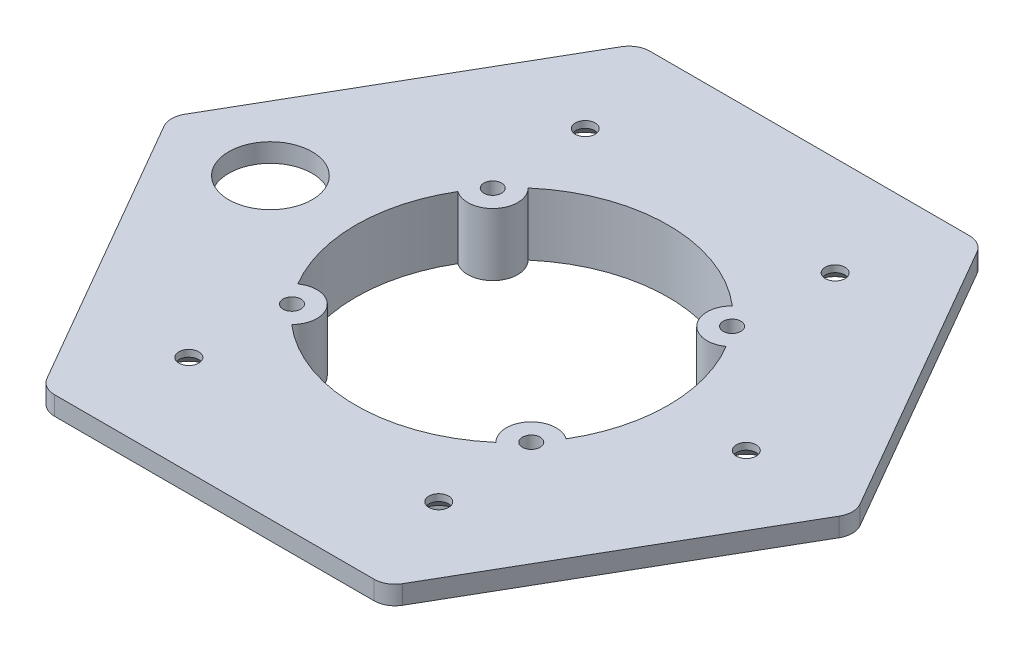
ISO-10303-21;
HEADER;
FILE_DESCRIPTION(('STEP AP214'),'2;1');
FILE_NAME('part.step','',(''),(''),'','','');
FILE_SCHEMA(('AUTOMOTIVE_DESIGN { 1 0 10303 214 1 1 1 1 }'));
ENDSEC;
DATA;
#1=APPLICATION_CONTEXT('core data for automotive mechanical design processes');
#2=APPLICATION_PROTOCOL_DEFINITION('international standard','automotive_design',2000,#1);
#3=PRODUCT_CONTEXT('',#1,'mechanical');
#4=PRODUCT('Part','Part','',(#3));
#5=PRODUCT_RELATED_PRODUCT_CATEGORY('part','',(#4));
#6=PRODUCT_DEFINITION_FORMATION('','',#4);
#7=PRODUCT_DEFINITION_CONTEXT('part definition',#1,'design');
#8=PRODUCT_DEFINITION('design','',#6,#7);
#9=PRODUCT_DEFINITION_SHAPE('','',#8);
#10=(LENGTH_UNIT() NAMED_UNIT(*) SI_UNIT(.MILLI.,.METRE.));
#11=(NAMED_UNIT(*) PLANE_ANGLE_UNIT() SI_UNIT($,.RADIAN.));
#12=(NAMED_UNIT(*) SI_UNIT($,.STERADIAN.) SOLID_ANGLE_UNIT());
#13=UNCERTAINTY_MEASURE_WITH_UNIT(LENGTH_MEASURE(1.E-05),#10,'distance_accuracy_value','');
#14=(GEOMETRIC_REPRESENTATION_CONTEXT(3) GLOBAL_UNCERTAINTY_ASSIGNED_CONTEXT((#13)) GLOBAL_UNIT_ASSIGNED_CONTEXT((#10,
#11,#12)) REPRESENTATION_CONTEXT('',''));
#15=CARTESIAN_POINT('',(0.,0.,0.));
#16=DIRECTION('',(0.,0.,1.));
#17=DIRECTION('',(1.,0.,0.));
#18=AXIS2_PLACEMENT_3D('',#15,#16,#17);
#19=CARTESIAN_POINT('',(0.,1.8,0.));
#20=DIRECTION('',(0.,1.,0.));
#21=DIRECTION('',(0.,0.,1.));
#22=AXIS2_PLACEMENT_3D('',#19,#20,#21);
#23=PLANE('',#22);
#24=CARTESIAN_POINT('',(-23.2,1.8,0.));
#25=DIRECTION('',(0.,1.,0.));
#26=DIRECTION('',(0.,0.,1.));
#27=AXIS2_PLACEMENT_3D('',#24,#25,#26);
#28=CIRCLE('',#27,4.);
#29=CARTESIAN_POINT('',(-23.2,1.8,4.));
#30=VERTEX_POINT('',#29);
#31=EDGE_CURVE('E195',#30,#30,#28,.T.);
#32=ORIENTED_EDGE('',*,*,#31,.F.);
#33=EDGE_LOOP('',(#32));
#34=FACE_BOUND('',#33,.T.);
#35=CARTESIAN_POINT('',(-11.4906666467847,1.8,-9.64181414529802));
#36=DIRECTION('',(0.,1.,0.));
#37=DIRECTION('',(0.,0.,1.));
#38=AXIS2_PLACEMENT_3D('',#35,#36,#37);
#39=CIRCLE('',#38,0.85);
#40=CARTESIAN_POINT('',(-11.4906666467847,1.8,-8.79181414529802));
#41=VERTEX_POINT('',#40);
#42=EDGE_CURVE('E231',#41,#41,#39,.F.);
#43=ORIENTED_EDGE('',*,*,#42,.T.);
#44=EDGE_LOOP('',(#43));
#45=FACE_BOUND('',#44,.T.);
#46=CARTESIAN_POINT('',(-11.4906666467847,1.8,9.64181414529802));
#47=DIRECTION('',(0.,1.,0.));
#48=DIRECTION('',(0.,0.,1.));
#49=AXIS2_PLACEMENT_3D('',#46,#47,#48);
#50=CIRCLE('',#49,0.85);
#51=CARTESIAN_POINT('',(-11.4906666467847,1.8,10.491814145298));
#52=VERTEX_POINT('',#51);
#53=EDGE_CURVE('E198',#52,#52,#50,.F.);
#54=ORIENTED_EDGE('',*,*,#53,.T.);
#55=EDGE_LOOP('',(#54));
#56=FACE_BOUND('',#55,.T.);
#57=CARTESIAN_POINT('',(0.,1.8,0.));
#58=DIRECTION('',(0.,1.,0.));
#59=DIRECTION('',(0.,0.,1.));
#60=AXIS2_PLACEMENT_3D('',#57,#58,#59);
#61=CIRCLE('',#60,15.);
#62=CARTESIAN_POINT('',(-9.80584038325173,1.8,11.3510129230034));
#63=VERTEX_POINT('',#62);
#64=CARTESIAN_POINT('',(9.80584038325173,1.8,11.3510129230034));
#65=VERTEX_POINT('',#64);
#66=EDGE_CURVE('E170',#63,#65,#61,.T.);
#67=ORIENTED_EDGE('',*,*,#66,.F.);
#68=CARTESIAN_POINT('',(-11.4906666467847,1.8,9.64181414529802));
#69=DIRECTION('',(0.,1.,0.));
#70=DIRECTION('',(0.,0.,1.));
#71=AXIS2_PLACEMENT_3D('',#68,#69,#70);
#72=CIRCLE('',#71,2.40000000000001);
#73=CARTESIAN_POINT('',(-12.88133184416,1.8,7.68578492547304));
#74=VERTEX_POINT('',#73);
#75=EDGE_CURVE('E174',#74,#63,#72,.F.);
#76=ORIENTED_EDGE('',*,*,#75,.F.);
#77=CARTESIAN_POINT('',(-12.88133184416,1.8,-7.68578492547304));
#78=VERTEX_POINT('',#77);
#79=EDGE_CURVE('E51',#78,#74,#61,.T.);
#80=ORIENTED_EDGE('',*,*,#79,.F.);
#81=CARTESIAN_POINT('',(-11.4906666467847,1.8,-9.64181414529802));
#82=DIRECTION('',(0.,1.,0.));
#83=DIRECTION('',(0.,0.,1.));
#84=AXIS2_PLACEMENT_3D('',#81,#82,#83);
#85=CIRCLE('',#84,2.40000000000001);
#86=CARTESIAN_POINT('',(-9.80584038325173,1.8,-11.3510129230034));
#87=VERTEX_POINT('',#86);
#88=EDGE_CURVE('E226',#87,#78,#85,.F.);
#89=ORIENTED_EDGE('',*,*,#88,.F.);
#90=CARTESIAN_POINT('',(9.80584038325173,1.8,-11.3510129230034));
#91=VERTEX_POINT('',#90);
#92=EDGE_CURVE('E181',#91,#87,#61,.T.);
#93=ORIENTED_EDGE('',*,*,#92,.F.);
#94=CARTESIAN_POINT('',(11.4906666467847,1.8,-9.64181414529802));
#95=DIRECTION('',(0.,1.,0.));
#96=DIRECTION('',(0.,0.,1.));
#97=AXIS2_PLACEMENT_3D('',#94,#95,#96);
#98=CIRCLE('',#97,2.40000000000001);
#99=CARTESIAN_POINT('',(12.88133184416,1.8,-7.68578492547304));
#100=VERTEX_POINT('',#99);
#101=EDGE_CURVE('E206',#100,#91,#98,.F.);
#102=ORIENTED_EDGE('',*,*,#101,.F.);
#103=CARTESIAN_POINT('',(12.88133184416,1.8,7.68578492547303));
#104=VERTEX_POINT('',#103);
#105=EDGE_CURVE('E179',#104,#100,#61,.T.);
#106=ORIENTED_EDGE('',*,*,#105,.F.);
#107=CARTESIAN_POINT('',(11.4906666467847,1.8,9.64181414529802));
#108=DIRECTION('',(0.,1.,0.));
#109=DIRECTION('',(0.,0.,1.));
#110=AXIS2_PLACEMENT_3D('',#107,#108,#109);
#111=CIRCLE('',#110,2.40000000000001);
#112=EDGE_CURVE('E176',#65,#104,#111,.F.);
#113=ORIENTED_EDGE('',*,*,#112,.F.);
#114=EDGE_LOOP('',(#67,#76,#80,#89,#93,#102,#106,#113));
#115=FACE_BOUND('',#114,.T.);
#116=CARTESIAN_POINT('',(12.,1.8,19.0328663106743));
#117=DIRECTION('',(0.,1.,0.));
#118=DIRECTION('',(0.,0.,1.));
#119=AXIS2_PLACEMENT_3D('',#116,#117,#118);
#120=CIRCLE('',#119,0.949999999999999);
#121=CARTESIAN_POINT('',(12.,1.8,19.9828663106743));
#122=VERTEX_POINT('',#121);
#123=EDGE_CURVE('E269',#122,#122,#120,.T.);
#124=ORIENTED_EDGE('',*,*,#123,.F.);
#125=EDGE_LOOP('',(#124));
#126=FACE_BOUND('',#125,.T.);
#127=CARTESIAN_POINT('',(-12.,1.8,-19.0328663106743));
#128=DIRECTION('',(0.,1.,0.));
#129=DIRECTION('',(0.,0.,1.));
#130=AXIS2_PLACEMENT_3D('',#127,#128,#129);
#131=CIRCLE('',#130,0.949999999999999);
#132=CARTESIAN_POINT('',(-12.,1.8,-18.0828663106743));
#133=VERTEX_POINT('',#132);
#134=EDGE_CURVE('E278',#133,#133,#131,.T.);
#135=ORIENTED_EDGE('',*,*,#134,.F.);
#136=EDGE_LOOP('',(#135));
#137=FACE_BOUND('',#136,.T.);
#138=DIRECTION('',(0.5,0.,-0.866025403784439));
#139=VECTOR('',#138,1.);
#140=CARTESIAN_POINT('',(16.5,1.8,28.5788383248865));
#141=LINE('',#140,#139);
#142=CARTESIAN_POINT('',(17.0773502691896,1.8,27.5788383248865));
#143=VERTEX_POINT('',#142);
#144=CARTESIAN_POINT('',(32.4226497308104,1.8,0.99999999999998));
#145=VERTEX_POINT('',#144);
#146=EDGE_CURVE('E282',#143,#145,#141,.T.);
#147=ORIENTED_EDGE('',*,*,#146,.T.);
#148=CARTESIAN_POINT('',(30.6905989232415,1.8,0.));
#149=DIRECTION('',(0.,1.,0.));
#150=DIRECTION('',(0.,0.,1.));
#151=AXIS2_PLACEMENT_3D('',#148,#149,#150);
#152=CIRCLE('',#151,2.);
#153=CARTESIAN_POINT('',(32.4226497308104,1.8,-1.00000000000002));
#154=VERTEX_POINT('',#153);
#155=EDGE_CURVE('E349',#145,#154,#152,.T.);
#156=ORIENTED_EDGE('',*,*,#155,.T.);
#157=DIRECTION('',(-0.5,0.,-0.866025403784439));
#158=VECTOR('',#157,1.);
#159=CARTESIAN_POINT('',(33.,1.8,0.));
#160=LINE('',#159,#158);
#161=CARTESIAN_POINT('',(17.0773502691896,1.8,-27.5788383248865));
#162=VERTEX_POINT('',#161);
#163=EDGE_CURVE('E285',#154,#162,#160,.T.);
#164=ORIENTED_EDGE('',*,*,#163,.T.);
#165=CARTESIAN_POINT('',(15.3452994616207,1.8,-26.5788383248865));
#166=DIRECTION('',(0.,1.,0.));
#167=DIRECTION('',(0.,0.,1.));
#168=AXIS2_PLACEMENT_3D('',#165,#166,#167);
#169=CIRCLE('',#168,2.);
#170=CARTESIAN_POINT('',(15.3452994616207,1.8,-28.5788383248865));
#171=VERTEX_POINT('',#170);
#172=EDGE_CURVE('E341',#162,#171,#169,.T.);
#173=ORIENTED_EDGE('',*,*,#172,.T.);
#174=DIRECTION('',(-1.,0.,0.));
#175=VECTOR('',#174,1.);
#176=CARTESIAN_POINT('',(16.5,1.8,-28.5788383248865));
#177=LINE('',#176,#175);
#178=CARTESIAN_POINT('',(-15.3452994616207,1.8,-28.5788383248865));
#179=VERTEX_POINT('',#178);
#180=EDGE_CURVE('E289',#171,#179,#177,.T.);
#181=ORIENTED_EDGE('',*,*,#180,.T.);
#182=CARTESIAN_POINT('',(-15.3452994616207,1.8,-26.5788383248865));
#183=DIRECTION('',(0.,1.,0.));
#184=DIRECTION('',(0.,0.,1.));
#185=AXIS2_PLACEMENT_3D('',#182,#183,#184);
#186=CIRCLE('',#185,2.);
#187=CARTESIAN_POINT('',(-17.0773502691896,1.8,-27.5788383248865));
#188=VERTEX_POINT('',#187);
#189=EDGE_CURVE('E339',#179,#188,#186,.T.);
#190=ORIENTED_EDGE('',*,*,#189,.T.);
#191=DIRECTION('',(-0.5,0.,0.866025403784439));
#192=VECTOR('',#191,1.);
#193=CARTESIAN_POINT('',(-16.5,1.8,-28.5788383248865));
#194=LINE('',#193,#192);
#195=CARTESIAN_POINT('',(-32.4226497308104,1.8,-1.));
#196=VERTEX_POINT('',#195);
#197=EDGE_CURVE('E292',#188,#196,#194,.T.);
#198=ORIENTED_EDGE('',*,*,#197,.T.);
#199=CARTESIAN_POINT('',(-30.6905989232415,1.8,0.));
#200=DIRECTION('',(0.,1.,0.));
#201=DIRECTION('',(0.,0.,1.));
#202=AXIS2_PLACEMENT_3D('',#199,#200,#201);
#203=CIRCLE('',#202,2.);
#204=CARTESIAN_POINT('',(-32.4226497308104,1.8,1.00000000000001));
#205=VERTEX_POINT('',#204);
#206=EDGE_CURVE('E347',#196,#205,#203,.T.);
#207=ORIENTED_EDGE('',*,*,#206,.T.);
#208=DIRECTION('',(0.5,0.,0.866025403784438));
#209=VECTOR('',#208,1.);
#210=CARTESIAN_POINT('',(-33.,1.8,0.));
#211=LINE('',#210,#209);
#212=CARTESIAN_POINT('',(-17.0773502691896,1.8,27.5788383248865));
#213=VERTEX_POINT('',#212);
#214=EDGE_CURVE('E295',#205,#213,#211,.T.);
#215=ORIENTED_EDGE('',*,*,#214,.T.);
#216=CARTESIAN_POINT('',(-15.3452994616207,1.8,26.5788383248865));
#217=DIRECTION('',(0.,1.,0.));
#218=DIRECTION('',(0.,0.,1.));
#219=AXIS2_PLACEMENT_3D('',#216,#217,#218);
#220=CIRCLE('',#219,2.);
#221=CARTESIAN_POINT('',(-15.3452994616207,1.8,28.5788383248865));
#222=VERTEX_POINT('',#221);
#223=EDGE_CURVE('E343',#213,#222,#220,.T.);
#224=ORIENTED_EDGE('',*,*,#223,.T.);
#225=DIRECTION('',(1.,0.,0.));
#226=VECTOR('',#225,1.);
#227=CARTESIAN_POINT('',(-16.5,1.8,28.5788383248865));
#228=LINE('',#227,#226);
#229=CARTESIAN_POINT('',(15.3452994616208,1.8,28.5788383248865));
#230=VERTEX_POINT('',#229);
#231=EDGE_CURVE('E298',#222,#230,#228,.T.);
#232=ORIENTED_EDGE('',*,*,#231,.T.);
#233=CARTESIAN_POINT('',(15.3452994616208,1.8,26.5788383248865));
#234=DIRECTION('',(0.,1.,0.));
#235=DIRECTION('',(0.,0.,1.));
#236=AXIS2_PLACEMENT_3D('',#233,#234,#235);
#237=CIRCLE('',#236,2.);
#238=EDGE_CURVE('E345',#230,#143,#237,.T.);
#239=ORIENTED_EDGE('',*,*,#238,.T.);
#240=EDGE_LOOP('',(#147,#156,#164,#173,#181,#190,#198,#207,#215,#224,#232,#239));
#241=FACE_BOUND('',#240,.T.);
#242=CARTESIAN_POINT('',(-12.,1.8,19.0328663106743));
#243=DIRECTION('',(0.,1.,0.));
#244=DIRECTION('',(0.,0.,-1.));
#245=AXIS2_PLACEMENT_3D('',#242,#243,#244);
#246=CIRCLE('',#245,0.949999999999999);
#247=CARTESIAN_POINT('',(-12.,1.8,18.0828663106743));
#248=VERTEX_POINT('',#247);
#249=EDGE_CURVE('E275',#248,#248,#246,.T.);
#250=ORIENTED_EDGE('',*,*,#249,.F.);
#251=EDGE_LOOP('',(#250));
#252=FACE_BOUND('',#251,.T.);
#253=CARTESIAN_POINT('',(22.5,1.8,0.));
#254=DIRECTION('',(0.,1.,0.));
#255=DIRECTION('',(0.,0.,-1.));
#256=AXIS2_PLACEMENT_3D('',#253,#254,#255);
#257=CIRCLE('',#256,0.950000000000001);
#258=CARTESIAN_POINT('',(22.5,1.8,-0.950000000000001));
#259=VERTEX_POINT('',#258);
#260=EDGE_CURVE('E272',#259,#259,#257,.T.);
#261=ORIENTED_EDGE('',*,*,#260,.F.);
#262=EDGE_LOOP('',(#261));
#263=FACE_BOUND('',#262,.T.);
#264=CARTESIAN_POINT('',(12.,1.8,-19.0328663106743));
#265=DIRECTION('',(0.,1.,0.));
#266=DIRECTION('',(0.,0.,-1.));
#267=AXIS2_PLACEMENT_3D('',#264,#265,#266);
#268=CIRCLE('',#267,0.949999999999999);
#269=CARTESIAN_POINT('',(12.,1.8,-19.9828663106743));
#270=VERTEX_POINT('',#269);
#271=EDGE_CURVE('E266',#270,#270,#268,.T.);
#272=ORIENTED_EDGE('',*,*,#271,.F.);
#273=EDGE_LOOP('',(#272));
#274=FACE_BOUND('',#273,.T.);
#275=CARTESIAN_POINT('',(11.4906666467847,1.8,-9.64181414529802));
#276=DIRECTION('',(0.,1.,0.));
#277=DIRECTION('',(0.,0.,1.));
#278=AXIS2_PLACEMENT_3D('',#275,#276,#277);
#279=CIRCLE('',#278,0.85);
#280=CARTESIAN_POINT('',(11.4906666467847,1.8,-8.79181414529802));
#281=VERTEX_POINT('',#280);
#282=EDGE_CURVE('E202',#281,#281,#279,.F.);
#283=ORIENTED_EDGE('',*,*,#282,.T.);
#284=EDGE_LOOP('',(#283));
#285=FACE_BOUND('',#284,.T.);
#286=CARTESIAN_POINT('',(11.4906666467847,1.8,9.64181414529802));
#287=DIRECTION('',(0.,1.,0.));
#288=DIRECTION('',(0.,0.,1.));
#289=AXIS2_PLACEMENT_3D('',#286,#287,#288);
#290=CIRCLE('',#289,0.85);
#291=CARTESIAN_POINT('',(11.4906666467847,1.8,10.491814145298));
#292=VERTEX_POINT('',#291);
#293=EDGE_CURVE('E220',#292,#292,#290,.F.);
#294=ORIENTED_EDGE('',*,*,#293,.T.);
#295=EDGE_LOOP('',(#294));
#296=FACE_BOUND('',#295,.T.);
#297=ADVANCED_FACE('F35',(#34,#45,#56,#115,#126,#137,#241,#252,#263,#274,#285,#296),#23,.T.);
#298=CARTESIAN_POINT('',(0.,-4.2,0.));
#299=DIRECTION('',(0.,-1.,0.));
#300=DIRECTION('',(0.,0.,-1.));
#301=AXIS2_PLACEMENT_3D('',#298,#299,#300);
#302=PLANE('',#301);
#303=CARTESIAN_POINT('',(-11.4906666467847,-4.2,-9.64181414529802));
#304=DIRECTION('',(0.,-1.,0.));
#305=DIRECTION('',(0.,0.,1.));
#306=AXIS2_PLACEMENT_3D('',#303,#304,#305);
#307=CIRCLE('',#306,0.85);
#308=CARTESIAN_POINT('',(-11.4906666467847,-4.2,-8.79181414529802));
#309=VERTEX_POINT('',#308);
#310=EDGE_CURVE('E232',#309,#309,#307,.T.);
#311=ORIENTED_EDGE('',*,*,#310,.F.);
#312=EDGE_LOOP('',(#311));
#313=FACE_BOUND('',#312,.T.);
#314=CARTESIAN_POINT('',(-11.4906666467847,-4.2,9.64181414529802));
#315=DIRECTION('',(0.,-1.,0.));
#316=DIRECTION('',(0.,0.,-1.));
#317=AXIS2_PLACEMENT_3D('',#314,#315,#316);
#318=CIRCLE('',#317,0.85);
#319=CARTESIAN_POINT('',(-11.4906666467847,-4.2,8.79181414529802));
#320=VERTEX_POINT('',#319);
#321=EDGE_CURVE('E189',#320,#320,#318,.T.);
#322=ORIENTED_EDGE('',*,*,#321,.F.);
#323=EDGE_LOOP('',(#322));
#324=FACE_BOUND('',#323,.T.);
#325=CARTESIAN_POINT('',(0.,-4.2,0.));
#326=DIRECTION('',(0.,-1.,0.));
#327=DIRECTION('',(0.,0.,-1.));
#328=AXIS2_PLACEMENT_3D('',#325,#326,#327);
#329=CIRCLE('',#328,15.);
#330=CARTESIAN_POINT('',(-12.88133184416,-4.2,7.68578492547304));
#331=VERTEX_POINT('',#330);
#332=CARTESIAN_POINT('',(-12.88133184416,-4.2,-7.68578492547304));
#333=VERTEX_POINT('',#332);
#334=EDGE_CURVE('E243',#331,#333,#329,.T.);
#335=ORIENTED_EDGE('',*,*,#334,.F.);
#336=CARTESIAN_POINT('',(-11.4906666467847,-4.2,9.64181414529802));
#337=DIRECTION('',(0.,-1.,0.));
#338=DIRECTION('',(0.,0.,-1.));
#339=AXIS2_PLACEMENT_3D('',#336,#337,#338);
#340=CIRCLE('',#339,2.40000000000001);
#341=CARTESIAN_POINT('',(-9.80584038325173,-4.2,11.3510129230034));
#342=VERTEX_POINT('',#341);
#343=EDGE_CURVE('E192',#331,#342,#340,.T.);
#344=ORIENTED_EDGE('',*,*,#343,.T.);
#345=CARTESIAN_POINT('',(9.80584038325173,-4.2,11.3510129230034));
#346=VERTEX_POINT('',#345);
#347=EDGE_CURVE('E184',#346,#342,#329,.T.);
#348=ORIENTED_EDGE('',*,*,#347,.F.);
#349=CARTESIAN_POINT('',(11.4906666467847,-4.2,9.64181414529802));
#350=DIRECTION('',(0.,-1.,0.));
#351=DIRECTION('',(0.,0.,1.));
#352=AXIS2_PLACEMENT_3D('',#349,#350,#351);
#353=CIRCLE('',#352,2.40000000000001);
#354=CARTESIAN_POINT('',(12.88133184416,-4.2,7.68578492547303));
#355=VERTEX_POINT('',#354);
#356=EDGE_CURVE('E217',#346,#355,#353,.T.);
#357=ORIENTED_EDGE('',*,*,#356,.T.);
#358=CARTESIAN_POINT('',(12.88133184416,-4.2,-7.68578492547304));
#359=VERTEX_POINT('',#358);
#360=EDGE_CURVE('E242',#359,#355,#329,.T.);
#361=ORIENTED_EDGE('',*,*,#360,.F.);
#362=CARTESIAN_POINT('',(11.4906666467847,-4.2,-9.64181414529802));
#363=DIRECTION('',(0.,-1.,0.));
#364=DIRECTION('',(0.,0.,-1.));
#365=AXIS2_PLACEMENT_3D('',#362,#363,#364);
#366=CIRCLE('',#365,2.40000000000001);
#367=CARTESIAN_POINT('',(9.80584038325173,-4.2,-11.3510129230034));
#368=VERTEX_POINT('',#367);
#369=EDGE_CURVE('E199',#359,#368,#366,.T.);
#370=ORIENTED_EDGE('',*,*,#369,.T.);
#371=CARTESIAN_POINT('',(-9.80584038325173,-4.2,-11.3510129230034));
#372=VERTEX_POINT('',#371);
#373=EDGE_CURVE('E239',#372,#368,#329,.T.);
#374=ORIENTED_EDGE('',*,*,#373,.F.);
#375=CARTESIAN_POINT('',(-11.4906666467847,-4.2,-9.64181414529802));
#376=DIRECTION('',(0.,-1.,0.));
#377=DIRECTION('',(0.,0.,1.));
#378=AXIS2_PLACEMENT_3D('',#375,#376,#377);
#379=CIRCLE('',#378,2.40000000000001);
#380=EDGE_CURVE('E228',#372,#333,#379,.T.);
#381=ORIENTED_EDGE('',*,*,#380,.T.);
#382=EDGE_LOOP('',(#335,#344,#348,#357,#361,#370,#374,#381));
#383=FACE_BOUND('',#382,.T.);
#384=CARTESIAN_POINT('',(0.,-4.2,0.));
#385=DIRECTION('',(0.,-1.,0.));
#386=DIRECTION('',(0.,0.,-1.));
#387=AXIS2_PLACEMENT_3D('',#384,#385,#386);
#388=CIRCLE('',#387,17.25);
#389=CARTESIAN_POINT('',(0.,-4.2,-17.25));
#390=VERTEX_POINT('',#389);
#391=EDGE_CURVE('E241',#390,#390,#388,.T.);
#392=ORIENTED_EDGE('',*,*,#391,.T.);
#393=EDGE_LOOP('',(#392));
#394=FACE_BOUND('',#393,.T.);
#395=CARTESIAN_POINT('',(11.4906666467847,-4.2,-9.64181414529802));
#396=DIRECTION('',(0.,-1.,0.));
#397=DIRECTION('',(0.,0.,-1.));
#398=AXIS2_PLACEMENT_3D('',#395,#396,#397);
#399=CIRCLE('',#398,0.85);
#400=CARTESIAN_POINT('',(11.4906666467847,-4.2,-10.491814145298));
#401=VERTEX_POINT('',#400);
#402=EDGE_CURVE('E203',#401,#401,#399,.T.);
#403=ORIENTED_EDGE('',*,*,#402,.F.);
#404=EDGE_LOOP('',(#403));
#405=FACE_BOUND('',#404,.T.);
#406=CARTESIAN_POINT('',(11.4906666467847,-4.2,9.64181414529802));
#407=DIRECTION('',(0.,-1.,0.));
#408=DIRECTION('',(0.,0.,1.));
#409=AXIS2_PLACEMENT_3D('',#406,#407,#408);
#410=CIRCLE('',#409,0.85);
#411=CARTESIAN_POINT('',(11.4906666467847,-4.2,10.491814145298));
#412=VERTEX_POINT('',#411);
#413=EDGE_CURVE('E221',#412,#412,#410,.T.);
#414=ORIENTED_EDGE('',*,*,#413,.F.);
#415=EDGE_LOOP('',(#414));
#416=FACE_BOUND('',#415,.T.);
#417=ADVANCED_FACE('F402',(#313,#324,#383,#394,#405,#416),#302,.T.);
#418=CARTESIAN_POINT('',(0.,-4.2,0.));
#419=DIRECTION('',(0.,1.,0.));
#420=DIRECTION('',(0.,0.,1.));
#421=AXIS2_PLACEMENT_3D('',#418,#419,#420);
#422=CYLINDRICAL_SURFACE('',#421,15.);
#423=DIRECTION('',(0.,-1.,0.));
#424=VECTOR('',#423,1.);
#425=CARTESIAN_POINT('',(-9.80584038325173,-1.2,11.3510129230034));
#426=LINE('',#425,#424);
#427=EDGE_CURVE('E11',#63,#342,#426,.T.);
#428=ORIENTED_EDGE('',*,*,#427,.F.);
#429=ORIENTED_EDGE('',*,*,#66,.T.);
#430=DIRECTION('',(0.,-1.,0.));
#431=VECTOR('',#430,1.);
#432=CARTESIAN_POINT('',(9.80584038325173,-1.2,11.3510129230034));
#433=LINE('',#432,#431);
#434=EDGE_CURVE('E390',#346,#65,#433,.F.);
#435=ORIENTED_EDGE('',*,*,#434,.F.);
#436=ORIENTED_EDGE('',*,*,#347,.T.);
#437=EDGE_LOOP('',(#428,#429,#435,#436));
#438=FACE_BOUND('',#437,.T.);
#439=ADVANCED_FACE('F182',(#438),#422,.F.);
#440=DIRECTION('',(0.,-1.,0.));
#441=VECTOR('',#440,1.);
#442=CARTESIAN_POINT('',(9.80584038325173,-1.2,-11.3510129230034));
#443=LINE('',#442,#441);
#444=EDGE_CURVE('E214',#91,#368,#443,.T.);
#445=ORIENTED_EDGE('',*,*,#444,.F.);
#446=ORIENTED_EDGE('',*,*,#92,.T.);
#447=DIRECTION('',(0.,-1.,0.));
#448=VECTOR('',#447,1.);
#449=CARTESIAN_POINT('',(-9.80584038325173,-1.2,-11.3510129230034));
#450=LINE('',#449,#448);
#451=EDGE_CURVE('E383',#372,#87,#450,.F.);
#452=ORIENTED_EDGE('',*,*,#451,.F.);
#453=ORIENTED_EDGE('',*,*,#373,.T.);
#454=EDGE_LOOP('',(#445,#446,#452,#453));
#455=FACE_BOUND('',#454,.T.);
#456=ADVANCED_FACE('F413',(#455),#422,.F.);
#457=DIRECTION('',(0.,-1.,0.));
#458=VECTOR('',#457,1.);
#459=CARTESIAN_POINT('',(12.88133184416,-1.2,-7.68578492547304));
#460=LINE('',#459,#458);
#461=EDGE_CURVE('E209',#359,#100,#460,.F.);
#462=ORIENTED_EDGE('',*,*,#461,.F.);
#463=ORIENTED_EDGE('',*,*,#360,.T.);
#464=DIRECTION('',(0.,-1.,0.));
#465=VECTOR('',#464,1.);
#466=CARTESIAN_POINT('',(12.88133184416,-1.2,7.68578492547303));
#467=LINE('',#466,#465);
#468=EDGE_CURVE('E392',#104,#355,#467,.T.);
#469=ORIENTED_EDGE('',*,*,#468,.F.);
#470=ORIENTED_EDGE('',*,*,#105,.T.);
#471=EDGE_LOOP('',(#462,#463,#469,#470));
#472=FACE_BOUND('',#471,.T.);
#473=ADVANCED_FACE('F417',(#472),#422,.F.);
#474=CARTESIAN_POINT('',(0.,0.,0.));
#475=DIRECTION('',(0.,1.,0.));
#476=DIRECTION('',(0.,0.,1.));
#477=AXIS2_PLACEMENT_3D('',#474,#475,#476);
#478=PLANE('',#477);
#479=CARTESIAN_POINT('',(-23.2,0.,0.));
#480=DIRECTION('',(0.,1.,0.));
#481=DIRECTION('',(0.,0.,1.));
#482=AXIS2_PLACEMENT_3D('',#479,#480,#481);
#483=CIRCLE('',#482,4.);
#484=CARTESIAN_POINT('',(-23.2,0.,4.));
#485=VERTEX_POINT('',#484);
#486=EDGE_CURVE('E39',#485,#485,#483,.T.);
#487=ORIENTED_EDGE('',*,*,#486,.T.);
#488=EDGE_LOOP('',(#487));
#489=FACE_BOUND('',#488,.T.);
#490=CARTESIAN_POINT('',(12.,0.,-19.0328663106743));
#491=DIRECTION('',(0.,-1.,0.));
#492=DIRECTION('',(0.,0.,-1.));
#493=AXIS2_PLACEMENT_3D('',#490,#491,#492);
#494=CIRCLE('',#493,2.1);
#495=CARTESIAN_POINT('',(12.,0.,-21.1328663106743));
#496=VERTEX_POINT('',#495);
#497=EDGE_CURVE('E246',#496,#496,#494,.T.);
#498=ORIENTED_EDGE('',*,*,#497,.F.);
#499=EDGE_LOOP('',(#498));
#500=FACE_BOUND('',#499,.T.);
#501=CARTESIAN_POINT('',(-12.,0.,-19.0328663106743));
#502=DIRECTION('',(0.,-1.,0.));
#503=DIRECTION('',(0.,0.,-1.));
#504=AXIS2_PLACEMENT_3D('',#501,#502,#503);
#505=CIRCLE('',#504,2.1);
#506=CARTESIAN_POINT('',(-12.,0.,-21.1328663106743));
#507=VERTEX_POINT('',#506);
#508=EDGE_CURVE('E250',#507,#507,#505,.T.);
#509=ORIENTED_EDGE('',*,*,#508,.F.);
#510=EDGE_LOOP('',(#509));
#511=FACE_BOUND('',#510,.T.);
#512=CARTESIAN_POINT('',(-12.,0.,19.0328663106743));
#513=DIRECTION('',(0.,-1.,0.));
#514=DIRECTION('',(0.,0.,-1.));
#515=AXIS2_PLACEMENT_3D('',#512,#513,#514);
#516=CIRCLE('',#515,2.1);
#517=CARTESIAN_POINT('',(-12.,0.,16.9328663106743));
#518=VERTEX_POINT('',#517);
#519=EDGE_CURVE('E254',#518,#518,#516,.T.);
#520=ORIENTED_EDGE('',*,*,#519,.F.);
#521=EDGE_LOOP('',(#520));
#522=FACE_BOUND('',#521,.T.);
#523=CARTESIAN_POINT('',(12.,0.,19.0328663106743));
#524=DIRECTION('',(0.,-1.,0.));
#525=DIRECTION('',(0.,0.,-1.));
#526=AXIS2_PLACEMENT_3D('',#523,#524,#525);
#527=CIRCLE('',#526,2.1);
#528=CARTESIAN_POINT('',(12.,0.,16.9328663106743));
#529=VERTEX_POINT('',#528);
#530=EDGE_CURVE('E258',#529,#529,#527,.T.);
#531=ORIENTED_EDGE('',*,*,#530,.F.);
#532=EDGE_LOOP('',(#531));
#533=FACE_BOUND('',#532,.T.);
#534=DIRECTION('',(-0.5,0.,-0.866025403784439));
#535=VECTOR('',#534,1.);
#536=CARTESIAN_POINT('',(33.,0.,0.));
#537=LINE('',#536,#535);
#538=CARTESIAN_POINT('',(32.4226497308104,0.,-1.00000000000002));
#539=VERTEX_POINT('',#538);
#540=CARTESIAN_POINT('',(17.0773502691896,0.,-27.5788383248865));
#541=VERTEX_POINT('',#540);
#542=EDGE_CURVE('E304',#539,#541,#537,.T.);
#543=ORIENTED_EDGE('',*,*,#542,.F.);
#544=CARTESIAN_POINT('',(30.6905989232415,0.,0.));
#545=DIRECTION('',(0.,1.,0.));
#546=DIRECTION('',(0.,0.,1.));
#547=AXIS2_PLACEMENT_3D('',#544,#545,#546);
#548=CIRCLE('',#547,2.);
#549=CARTESIAN_POINT('',(32.4226497308104,0.,0.99999999999998));
#550=VERTEX_POINT('',#549);
#551=EDGE_CURVE('E332',#539,#550,#548,.F.);
#552=ORIENTED_EDGE('',*,*,#551,.T.);
#553=DIRECTION('',(0.5,0.,-0.866025403784439));
#554=VECTOR('',#553,1.);
#555=CARTESIAN_POINT('',(16.5,0.,28.5788383248865));
#556=LINE('',#555,#554);
#557=CARTESIAN_POINT('',(17.0773502691896,0.,27.5788383248865));
#558=VERTEX_POINT('',#557);
#559=EDGE_CURVE('E281',#558,#550,#556,.T.);
#560=ORIENTED_EDGE('',*,*,#559,.F.);
#561=CARTESIAN_POINT('',(15.3452994616208,0.,26.5788383248865));
#562=DIRECTION('',(0.,1.,0.));
#563=DIRECTION('',(0.,0.,1.));
#564=AXIS2_PLACEMENT_3D('',#561,#562,#563);
#565=CIRCLE('',#564,2.);
#566=CARTESIAN_POINT('',(15.3452994616208,0.,28.5788383248865));
#567=VERTEX_POINT('',#566);
#568=EDGE_CURVE('E328',#558,#567,#565,.F.);
#569=ORIENTED_EDGE('',*,*,#568,.T.);
#570=DIRECTION('',(1.,0.,0.));
#571=VECTOR('',#570,1.);
#572=CARTESIAN_POINT('',(-16.5,0.,28.5788383248865));
#573=LINE('',#572,#571);
#574=CARTESIAN_POINT('',(-15.3452994616207,0.,28.5788383248865));
#575=VERTEX_POINT('',#574);
#576=EDGE_CURVE('E286',#575,#567,#573,.T.);
#577=ORIENTED_EDGE('',*,*,#576,.F.);
#578=CARTESIAN_POINT('',(-15.3452994616207,0.,26.5788383248865));
#579=DIRECTION('',(0.,1.,0.));
#580=DIRECTION('',(0.,0.,1.));
#581=AXIS2_PLACEMENT_3D('',#578,#579,#580);
#582=CIRCLE('',#581,2.);
#583=CARTESIAN_POINT('',(-17.0773502691896,0.,27.5788383248865));
#584=VERTEX_POINT('',#583);
#585=EDGE_CURVE('E326',#575,#584,#582,.F.);
#586=ORIENTED_EDGE('',*,*,#585,.T.);
#587=DIRECTION('',(0.5,0.,0.866025403784438));
#588=VECTOR('',#587,1.);
#589=CARTESIAN_POINT('',(-33.,0.,0.));
#590=LINE('',#589,#588);
#591=CARTESIAN_POINT('',(-32.4226497308104,0.,1.00000000000001));
#592=VERTEX_POINT('',#591);
#593=EDGE_CURVE('E313',#592,#584,#590,.T.);
#594=ORIENTED_EDGE('',*,*,#593,.F.);
#595=CARTESIAN_POINT('',(-30.6905989232415,0.,0.));
#596=DIRECTION('',(0.,1.,0.));
#597=DIRECTION('',(0.,0.,1.));
#598=AXIS2_PLACEMENT_3D('',#595,#596,#597);
#599=CIRCLE('',#598,2.);
#600=CARTESIAN_POINT('',(-32.4226497308104,0.,-1.));
#601=VERTEX_POINT('',#600);
#602=EDGE_CURVE('E330',#592,#601,#599,.F.);
#603=ORIENTED_EDGE('',*,*,#602,.T.);
#604=DIRECTION('',(-0.5,0.,0.866025403784439));
#605=VECTOR('',#604,1.);
#606=CARTESIAN_POINT('',(-16.5,0.,-28.5788383248865));
#607=LINE('',#606,#605);
#608=CARTESIAN_POINT('',(-17.0773502691896,0.,-27.5788383248865));
#609=VERTEX_POINT('',#608);
#610=EDGE_CURVE('E310',#609,#601,#607,.T.);
#611=ORIENTED_EDGE('',*,*,#610,.F.);
#612=CARTESIAN_POINT('',(-15.3452994616207,0.,-26.5788383248865));
#613=DIRECTION('',(0.,1.,0.));
#614=DIRECTION('',(0.,0.,1.));
#615=AXIS2_PLACEMENT_3D('',#612,#613,#614);
#616=CIRCLE('',#615,2.);
#617=CARTESIAN_POINT('',(-15.3452994616207,0.,-28.5788383248865));
#618=VERTEX_POINT('',#617);
#619=EDGE_CURVE('E322',#609,#618,#616,.F.);
#620=ORIENTED_EDGE('',*,*,#619,.T.);
#621=DIRECTION('',(-1.,0.,0.));
#622=VECTOR('',#621,1.);
#623=CARTESIAN_POINT('',(16.5,0.,-28.5788383248865));
#624=LINE('',#623,#622);
#625=CARTESIAN_POINT('',(15.3452994616207,0.,-28.5788383248865));
#626=VERTEX_POINT('',#625);
#627=EDGE_CURVE('E307',#626,#618,#624,.T.);
#628=ORIENTED_EDGE('',*,*,#627,.F.);
#629=CARTESIAN_POINT('',(15.3452994616207,0.,-26.5788383248865));
#630=DIRECTION('',(0.,1.,0.));
#631=DIRECTION('',(0.,0.,1.));
#632=AXIS2_PLACEMENT_3D('',#629,#630,#631);
#633=CIRCLE('',#632,2.);
#634=EDGE_CURVE('E324',#626,#541,#633,.F.);
#635=ORIENTED_EDGE('',*,*,#634,.T.);
#636=EDGE_LOOP('',(#543,#552,#560,#569,#577,#586,#594,#603,#611,#620,#628,#635));
#637=FACE_BOUND('',#636,.T.);
#638=CARTESIAN_POINT('',(22.5,0.,0.));
#639=DIRECTION('',(0.,-1.,0.));
#640=DIRECTION('',(0.,0.,-1.));
#641=AXIS2_PLACEMENT_3D('',#638,#639,#640);
#642=CIRCLE('',#641,2.1);
#643=CARTESIAN_POINT('',(22.5,0.,-2.1));
#644=VERTEX_POINT('',#643);
#645=EDGE_CURVE('E262',#644,#644,#642,.T.);
#646=ORIENTED_EDGE('',*,*,#645,.F.);
#647=EDGE_LOOP('',(#646));
#648=FACE_BOUND('',#647,.T.);
#649=CARTESIAN_POINT('',(0.,0.,0.));
#650=DIRECTION('',(0.,1.,0.));
#651=DIRECTION('',(0.,0.,1.));
#652=AXIS2_PLACEMENT_3D('',#649,#650,#651);
#653=CIRCLE('',#652,17.25);
#654=CARTESIAN_POINT('',(0.,0.,17.25));
#655=VERTEX_POINT('',#654);
#656=EDGE_CURVE('E371',#655,#655,#653,.F.);
#657=ORIENTED_EDGE('',*,*,#656,.F.);
#658=EDGE_LOOP('',(#657));
#659=FACE_BOUND('',#658,.T.);
#660=ADVANCED_FACE('F419',(#489,#500,#511,#522,#533,#637,#648,#659),#478,.F.);
#661=CARTESIAN_POINT('',(16.5,1.8,28.5788383248865));
#662=DIRECTION('',(-0.866025403784439,0.,-0.5));
#663=DIRECTION('',(-0.5,0.,0.866025403784439));
#664=AXIS2_PLACEMENT_3D('',#661,#662,#663);
#665=PLANE('',#664);
#666=ORIENTED_EDGE('',*,*,#559,.T.);
#667=DIRECTION('',(0.,-1.,0.));
#668=VECTOR('',#667,1.);
#669=CARTESIAN_POINT('',(32.4226497308104,1.8,0.99999999999998));
#670=LINE('',#669,#668);
#671=EDGE_CURVE('E337',#550,#145,#670,.F.);
#672=ORIENTED_EDGE('',*,*,#671,.T.);
#673=ORIENTED_EDGE('',*,*,#146,.F.);
#674=DIRECTION('',(0.,-1.,0.));
#675=VECTOR('',#674,1.);
#676=CARTESIAN_POINT('',(17.0773502691896,1.8,27.5788383248865));
#677=LINE('',#676,#675);
#678=EDGE_CURVE('E334',#143,#558,#677,.T.);
#679=ORIENTED_EDGE('',*,*,#678,.T.);
#680=EDGE_LOOP('',(#666,#672,#673,#679));
#681=FACE_BOUND('',#680,.T.);
#682=ADVANCED_FACE('F426',(#681),#665,.F.);
#683=CARTESIAN_POINT('',(33.,1.8,0.));
#684=DIRECTION('',(-0.866025403784438,0.,0.5));
#685=DIRECTION('',(0.5,0.,0.866025403784438));
#686=AXIS2_PLACEMENT_3D('',#683,#684,#685);
#687=PLANE('',#686);
#688=ORIENTED_EDGE('',*,*,#163,.F.);
#689=DIRECTION('',(0.,-1.,0.));
#690=VECTOR('',#689,1.);
#691=CARTESIAN_POINT('',(32.4226497308104,1.8,-1.00000000000002));
#692=LINE('',#691,#690);
#693=EDGE_CURVE('E319',#154,#539,#692,.T.);
#694=ORIENTED_EDGE('',*,*,#693,.T.);
#695=ORIENTED_EDGE('',*,*,#542,.T.);
#696=DIRECTION('',(0.,-1.,0.));
#697=VECTOR('',#696,1.);
#698=CARTESIAN_POINT('',(17.0773502691896,1.8,-27.5788383248865));
#699=LINE('',#698,#697);
#700=EDGE_CURVE('E301',#541,#162,#699,.F.);
#701=ORIENTED_EDGE('',*,*,#700,.T.);
#702=EDGE_LOOP('',(#688,#694,#695,#701));
#703=FACE_BOUND('',#702,.T.);
#704=ADVANCED_FACE('F462',(#703),#687,.F.);
#705=CARTESIAN_POINT('',(16.5,1.8,-28.5788383248865));
#706=DIRECTION('',(0.,0.,1.));
#707=DIRECTION('',(1.,0.,0.));
#708=AXIS2_PLACEMENT_3D('',#705,#706,#707);
#709=PLANE('',#708);
#710=ORIENTED_EDGE('',*,*,#180,.F.);
#711=DIRECTION('',(0.,-1.,0.));
#712=VECTOR('',#711,1.);
#713=CARTESIAN_POINT('',(15.3452994616207,1.8,-28.5788383248865));
#714=LINE('',#713,#712);
#715=EDGE_CURVE('E368',#171,#626,#714,.T.);
#716=ORIENTED_EDGE('',*,*,#715,.T.);
#717=ORIENTED_EDGE('',*,*,#627,.T.);
#718=DIRECTION('',(0.,-1.,0.));
#719=VECTOR('',#718,1.);
#720=CARTESIAN_POINT('',(-15.3452994616207,1.8,-28.5788383248865));
#721=LINE('',#720,#719);
#722=EDGE_CURVE('E366',#618,#179,#721,.F.);
#723=ORIENTED_EDGE('',*,*,#722,.T.);
#724=EDGE_LOOP('',(#710,#716,#717,#723));
#725=FACE_BOUND('',#724,.T.);
#726=ADVANCED_FACE('F458',(#725),#709,.F.);
#727=CARTESIAN_POINT('',(-16.5,1.8,-28.5788383248865));
#728=DIRECTION('',(0.866025403784439,0.,0.5));
#729=DIRECTION('',(0.5,0.,-0.866025403784439));
#730=AXIS2_PLACEMENT_3D('',#727,#728,#729);
#731=PLANE('',#730);
#732=ORIENTED_EDGE('',*,*,#610,.T.);
#733=DIRECTION('',(0.,-1.,0.));
#734=VECTOR('',#733,1.);
#735=CARTESIAN_POINT('',(-32.4226497308104,1.8,-0.999999999999994));
#736=LINE('',#735,#734);
#737=EDGE_CURVE('E359',#601,#196,#736,.F.);
#738=ORIENTED_EDGE('',*,*,#737,.T.);
#739=ORIENTED_EDGE('',*,*,#197,.F.);
#740=DIRECTION('',(0.,-1.,0.));
#741=VECTOR('',#740,1.);
#742=CARTESIAN_POINT('',(-17.0773502691896,1.8,-27.5788383248865));
#743=LINE('',#742,#741);
#744=EDGE_CURVE('E356',#188,#609,#743,.T.);
#745=ORIENTED_EDGE('',*,*,#744,.T.);
#746=EDGE_LOOP('',(#732,#738,#739,#745));
#747=FACE_BOUND('',#746,.T.);
#748=ADVANCED_FACE('F454',(#747),#731,.F.);
#749=CARTESIAN_POINT('',(-33.,1.8,0.));
#750=DIRECTION('',(0.866025403784439,0.,-0.5));
#751=DIRECTION('',(-0.5,0.,-0.866025403784439));
#752=AXIS2_PLACEMENT_3D('',#749,#750,#751);
#753=PLANE('',#752);
#754=ORIENTED_EDGE('',*,*,#214,.F.);
#755=DIRECTION('',(0.,-1.,0.));
#756=VECTOR('',#755,1.);
#757=CARTESIAN_POINT('',(-32.4226497308104,1.8,1.00000000000001));
#758=LINE('',#757,#756);
#759=EDGE_CURVE('E353',#205,#592,#758,.T.);
#760=ORIENTED_EDGE('',*,*,#759,.T.);
#761=ORIENTED_EDGE('',*,*,#593,.T.);
#762=DIRECTION('',(0.,-1.,0.));
#763=VECTOR('',#762,1.);
#764=CARTESIAN_POINT('',(-17.0773502691896,1.8,27.5788383248865));
#765=LINE('',#764,#763);
#766=EDGE_CURVE('E351',#584,#213,#765,.F.);
#767=ORIENTED_EDGE('',*,*,#766,.T.);
#768=EDGE_LOOP('',(#754,#760,#761,#767));
#769=FACE_BOUND('',#768,.T.);
#770=ADVANCED_FACE('F450',(#769),#753,.F.);
#771=CARTESIAN_POINT('',(-16.5,1.8,28.5788383248865));
#772=DIRECTION('',(0.,0.,-1.));
#773=DIRECTION('',(-1.,0.,0.));
#774=AXIS2_PLACEMENT_3D('',#771,#772,#773);
#775=PLANE('',#774);
#776=ORIENTED_EDGE('',*,*,#576,.T.);
#777=DIRECTION('',(0.,-1.,0.));
#778=VECTOR('',#777,1.);
#779=CARTESIAN_POINT('',(15.3452994616208,1.8,28.5788383248865));
#780=LINE('',#779,#778);
#781=EDGE_CURVE('E364',#567,#230,#780,.F.);
#782=ORIENTED_EDGE('',*,*,#781,.T.);
#783=ORIENTED_EDGE('',*,*,#231,.F.);
#784=DIRECTION('',(0.,-1.,0.));
#785=VECTOR('',#784,1.);
#786=CARTESIAN_POINT('',(-15.3452994616207,1.8,28.5788383248865));
#787=LINE('',#786,#785);
#788=EDGE_CURVE('E361',#222,#575,#787,.T.);
#789=ORIENTED_EDGE('',*,*,#788,.T.);
#790=EDGE_LOOP('',(#776,#782,#783,#789));
#791=FACE_BOUND('',#790,.T.);
#792=ADVANCED_FACE('F447',(#791),#775,.F.);
#793=CARTESIAN_POINT('',(-12.,1.8,-19.0328663106743));
#794=DIRECTION('',(0.,-1.,0.));
#795=DIRECTION('',(0.,0.,-1.));
#796=AXIS2_PLACEMENT_3D('',#793,#794,#795);
#797=CYLINDRICAL_SURFACE('',#796,0.949999999999999);
#798=CARTESIAN_POINT('',(-12.,1.15,-19.0328663106743));
#799=DIRECTION('',(0.,-1.,0.));
#800=DIRECTION('',(0.,0.,-1.));
#801=AXIS2_PLACEMENT_3D('',#798,#799,#800);
#802=CIRCLE('',#801,0.949999999999999);
#803=CARTESIAN_POINT('',(-12.,1.15,-19.9828663106743));
#804=VERTEX_POINT('',#803);
#805=EDGE_CURVE('E253',#804,#804,#802,.F.);
#806=ORIENTED_EDGE('',*,*,#805,.F.);
#807=EDGE_LOOP('',(#806));
#808=FACE_BOUND('',#807,.T.);
#809=ORIENTED_EDGE('',*,*,#134,.T.);
#810=EDGE_LOOP('',(#809));
#811=FACE_BOUND('',#810,.T.);
#812=ADVANCED_FACE('F444',(#808,#811),#797,.F.);
#813=CARTESIAN_POINT('',(-12.,1.8,19.0328663106743));
#814=DIRECTION('',(0.,-1.,0.));
#815=DIRECTION('',(0.,0.,-1.));
#816=AXIS2_PLACEMENT_3D('',#813,#814,#815);
#817=CYLINDRICAL_SURFACE('',#816,0.949999999999999);
#818=CARTESIAN_POINT('',(-12.,1.15,19.0328663106743));
#819=DIRECTION('',(0.,-1.,0.));
#820=DIRECTION('',(0.,0.,-1.));
#821=AXIS2_PLACEMENT_3D('',#818,#819,#820);
#822=CIRCLE('',#821,0.949999999999999);
#823=CARTESIAN_POINT('',(-12.,1.15,18.0828663106743));
#824=VERTEX_POINT('',#823);
#825=EDGE_CURVE('E257',#824,#824,#822,.F.);
#826=ORIENTED_EDGE('',*,*,#825,.F.);
#827=EDGE_LOOP('',(#826));
#828=FACE_BOUND('',#827,.T.);
#829=ORIENTED_EDGE('',*,*,#249,.T.);
#830=EDGE_LOOP('',(#829));
#831=FACE_BOUND('',#830,.T.);
#832=ADVANCED_FACE('F567',(#828,#831),#817,.F.);
#833=CARTESIAN_POINT('',(22.5,1.8,0.));
#834=DIRECTION('',(0.,-1.,0.));
#835=DIRECTION('',(0.,0.,-1.));
#836=AXIS2_PLACEMENT_3D('',#833,#834,#835);
#837=CYLINDRICAL_SURFACE('',#836,0.950000000000001);
#838=CARTESIAN_POINT('',(22.5,1.15,0.));
#839=DIRECTION('',(0.,-1.,0.));
#840=DIRECTION('',(0.,0.,-1.));
#841=AXIS2_PLACEMENT_3D('',#838,#839,#840);
#842=CIRCLE('',#841,0.950000000000001);
#843=CARTESIAN_POINT('',(22.5,1.15,-0.950000000000001));
#844=VERTEX_POINT('',#843);
#845=EDGE_CURVE('E265',#844,#844,#842,.F.);
#846=ORIENTED_EDGE('',*,*,#845,.F.);
#847=EDGE_LOOP('',(#846));
#848=FACE_BOUND('',#847,.T.);
#849=ORIENTED_EDGE('',*,*,#260,.T.);
#850=EDGE_LOOP('',(#849));
#851=FACE_BOUND('',#850,.T.);
#852=ADVANCED_FACE('F564',(#848,#851),#837,.F.);
#853=CARTESIAN_POINT('',(12.,1.8,19.0328663106743));
#854=DIRECTION('',(0.,-1.,0.));
#855=DIRECTION('',(0.,0.,-1.));
#856=AXIS2_PLACEMENT_3D('',#853,#854,#855);
#857=CYLINDRICAL_SURFACE('',#856,0.949999999999999);
#858=CARTESIAN_POINT('',(12.,1.15,19.0328663106743));
#859=DIRECTION('',(0.,-1.,0.));
#860=DIRECTION('',(0.,0.,-1.));
#861=AXIS2_PLACEMENT_3D('',#858,#859,#860);
#862=CIRCLE('',#861,0.949999999999999);
#863=CARTESIAN_POINT('',(12.,1.15,18.0828663106743));
#864=VERTEX_POINT('',#863);
#865=EDGE_CURVE('E261',#864,#864,#862,.F.);
#866=ORIENTED_EDGE('',*,*,#865,.F.);
#867=EDGE_LOOP('',(#866));
#868=FACE_BOUND('',#867,.T.);
#869=ORIENTED_EDGE('',*,*,#123,.T.);
#870=EDGE_LOOP('',(#869));
#871=FACE_BOUND('',#870,.T.);
#872=ADVANCED_FACE('F560',(#868,#871),#857,.F.);
#873=CARTESIAN_POINT('',(12.,1.8,-19.0328663106743));
#874=DIRECTION('',(0.,-1.,0.));
#875=DIRECTION('',(0.,0.,-1.));
#876=AXIS2_PLACEMENT_3D('',#873,#874,#875);
#877=CYLINDRICAL_SURFACE('',#876,0.949999999999999);
#878=CARTESIAN_POINT('',(12.,1.15,-19.0328663106743));
#879=DIRECTION('',(0.,-1.,0.));
#880=DIRECTION('',(0.,0.,-1.));
#881=AXIS2_PLACEMENT_3D('',#878,#879,#880);
#882=CIRCLE('',#881,0.949999999999999);
#883=CARTESIAN_POINT('',(12.,1.15,-19.9828663106743));
#884=VERTEX_POINT('',#883);
#885=EDGE_CURVE('E249',#884,#884,#882,.F.);
#886=ORIENTED_EDGE('',*,*,#885,.F.);
#887=EDGE_LOOP('',(#886));
#888=FACE_BOUND('',#887,.T.);
#889=ORIENTED_EDGE('',*,*,#271,.T.);
#890=EDGE_LOOP('',(#889));
#891=FACE_BOUND('',#890,.T.);
#892=ADVANCED_FACE('F474',(#888,#891),#877,.F.);
#893=CARTESIAN_POINT('',(30.6905989232415,1.8,0.));
#894=DIRECTION('',(0.,-1.,0.));
#895=DIRECTION('',(0.,0.,-1.));
#896=AXIS2_PLACEMENT_3D('',#893,#894,#895);
#897=CYLINDRICAL_SURFACE('',#896,2.);
#898=ORIENTED_EDGE('',*,*,#155,.F.);
#899=ORIENTED_EDGE('',*,*,#671,.F.);
#900=ORIENTED_EDGE('',*,*,#551,.F.);
#901=ORIENTED_EDGE('',*,*,#693,.F.);
#902=EDGE_LOOP('',(#898,#899,#900,#901));
#903=FACE_BOUND('',#902,.T.);
#904=ADVANCED_FACE('F470',(#903),#897,.T.);
#905=CARTESIAN_POINT('',(-30.6905989232415,1.8,0.));
#906=DIRECTION('',(0.,-1.,0.));
#907=DIRECTION('',(0.,0.,-1.));
#908=AXIS2_PLACEMENT_3D('',#905,#906,#907);
#909=CYLINDRICAL_SURFACE('',#908,2.);
#910=ORIENTED_EDGE('',*,*,#206,.F.);
#911=ORIENTED_EDGE('',*,*,#737,.F.);
#912=ORIENTED_EDGE('',*,*,#602,.F.);
#913=ORIENTED_EDGE('',*,*,#759,.F.);
#914=EDGE_LOOP('',(#910,#911,#912,#913));
#915=FACE_BOUND('',#914,.T.);
#916=ADVANCED_FACE('F473',(#915),#909,.T.);
#917=CARTESIAN_POINT('',(15.3452994616208,1.8,26.5788383248865));
#918=DIRECTION('',(0.,-1.,0.));
#919=DIRECTION('',(0.,0.,-1.));
#920=AXIS2_PLACEMENT_3D('',#917,#918,#919);
#921=CYLINDRICAL_SURFACE('',#920,2.);
#922=ORIENTED_EDGE('',*,*,#238,.F.);
#923=ORIENTED_EDGE('',*,*,#781,.F.);
#924=ORIENTED_EDGE('',*,*,#568,.F.);
#925=ORIENTED_EDGE('',*,*,#678,.F.);
#926=EDGE_LOOP('',(#922,#923,#924,#925));
#927=FACE_BOUND('',#926,.T.);
#928=ADVANCED_FACE('F478',(#927),#921,.T.);
#929=CARTESIAN_POINT('',(-15.3452994616207,1.8,26.5788383248865));
#930=DIRECTION('',(0.,-1.,0.));
#931=DIRECTION('',(0.,0.,-1.));
#932=AXIS2_PLACEMENT_3D('',#929,#930,#931);
#933=CYLINDRICAL_SURFACE('',#932,2.);
#934=ORIENTED_EDGE('',*,*,#223,.F.);
#935=ORIENTED_EDGE('',*,*,#766,.F.);
#936=ORIENTED_EDGE('',*,*,#585,.F.);
#937=ORIENTED_EDGE('',*,*,#788,.F.);
#938=EDGE_LOOP('',(#934,#935,#936,#937));
#939=FACE_BOUND('',#938,.T.);
#940=ADVANCED_FACE('F482',(#939),#933,.T.);
#941=CARTESIAN_POINT('',(15.3452994616207,1.8,-26.5788383248865));
#942=DIRECTION('',(0.,-1.,0.));
#943=DIRECTION('',(0.,0.,-1.));
#944=AXIS2_PLACEMENT_3D('',#941,#942,#943);
#945=CYLINDRICAL_SURFACE('',#944,2.);
#946=ORIENTED_EDGE('',*,*,#172,.F.);
#947=ORIENTED_EDGE('',*,*,#700,.F.);
#948=ORIENTED_EDGE('',*,*,#634,.F.);
#949=ORIENTED_EDGE('',*,*,#715,.F.);
#950=EDGE_LOOP('',(#946,#947,#948,#949));
#951=FACE_BOUND('',#950,.T.);
#952=ADVANCED_FACE('F485',(#951),#945,.T.);
#953=CARTESIAN_POINT('',(-15.3452994616207,1.8,-26.5788383248865));
#954=DIRECTION('',(0.,-1.,0.));
#955=DIRECTION('',(0.,0.,-1.));
#956=AXIS2_PLACEMENT_3D('',#953,#954,#955);
#957=CYLINDRICAL_SURFACE('',#956,2.);
#958=ORIENTED_EDGE('',*,*,#189,.F.);
#959=ORIENTED_EDGE('',*,*,#722,.F.);
#960=ORIENTED_EDGE('',*,*,#619,.F.);
#961=ORIENTED_EDGE('',*,*,#744,.F.);
#962=EDGE_LOOP('',(#958,#959,#960,#961));
#963=FACE_BOUND('',#962,.T.);
#964=ADVANCED_FACE('F37',(#963),#957,.T.);
#965=CARTESIAN_POINT('',(22.5,0.,0.));
#966=DIRECTION('',(0.,-1.,0.));
#967=DIRECTION('',(0.,0.,-1.));
#968=AXIS2_PLACEMENT_3D('',#965,#966,#967);
#969=CONICAL_SURFACE('',#968,2.1,0.78539816339745);
#970=ORIENTED_EDGE('',*,*,#845,.T.);
#971=EDGE_LOOP('',(#970));
#972=FACE_BOUND('',#971,.T.);
#973=ORIENTED_EDGE('',*,*,#645,.T.);
#974=EDGE_LOOP('',(#973));
#975=FACE_BOUND('',#974,.T.);
#976=ADVANCED_FACE('F492',(#972,#975),#969,.F.);
#977=CARTESIAN_POINT('',(12.,0.,19.0328663106743));
#978=DIRECTION('',(0.,-1.,0.));
#979=DIRECTION('',(0.,0.,-1.));
#980=AXIS2_PLACEMENT_3D('',#977,#978,#979);
#981=CONICAL_SURFACE('',#980,2.1,0.78539816339745);
#982=ORIENTED_EDGE('',*,*,#865,.T.);
#983=EDGE_LOOP('',(#982));
#984=FACE_BOUND('',#983,.T.);
#985=ORIENTED_EDGE('',*,*,#530,.T.);
#986=EDGE_LOOP('',(#985));
#987=FACE_BOUND('',#986,.T.);
#988=ADVANCED_FACE('F550',(#984,#987),#981,.F.);
#989=CARTESIAN_POINT('',(-12.,0.,19.0328663106743));
#990=DIRECTION('',(0.,-1.,0.));
#991=DIRECTION('',(0.,0.,-1.));
#992=AXIS2_PLACEMENT_3D('',#989,#990,#991);
#993=CONICAL_SURFACE('',#992,2.1,0.78539816339745);
#994=ORIENTED_EDGE('',*,*,#825,.T.);
#995=EDGE_LOOP('',(#994));
#996=FACE_BOUND('',#995,.T.);
#997=ORIENTED_EDGE('',*,*,#519,.T.);
#998=EDGE_LOOP('',(#997));
#999=FACE_BOUND('',#998,.T.);
#1000=ADVANCED_FACE('F546',(#996,#999),#993,.F.);
#1001=CARTESIAN_POINT('',(-12.,0.,-19.0328663106743));
#1002=DIRECTION('',(0.,-1.,0.));
#1003=DIRECTION('',(0.,0.,-1.));
#1004=AXIS2_PLACEMENT_3D('',#1001,#1002,#1003);
#1005=CONICAL_SURFACE('',#1004,2.1,0.78539816339745);
#1006=ORIENTED_EDGE('',*,*,#805,.T.);
#1007=EDGE_LOOP('',(#1006));
#1008=FACE_BOUND('',#1007,.T.);
#1009=ORIENTED_EDGE('',*,*,#508,.T.);
#1010=EDGE_LOOP('',(#1009));
#1011=FACE_BOUND('',#1010,.T.);
#1012=ADVANCED_FACE('F539',(#1008,#1011),#1005,.F.);
#1013=CARTESIAN_POINT('',(12.,0.,-19.0328663106743));
#1014=DIRECTION('',(0.,-1.,0.));
#1015=DIRECTION('',(0.,0.,-1.));
#1016=AXIS2_PLACEMENT_3D('',#1013,#1014,#1015);
#1017=CONICAL_SURFACE('',#1016,2.1,0.78539816339745);
#1018=ORIENTED_EDGE('',*,*,#885,.T.);
#1019=EDGE_LOOP('',(#1018));
#1020=FACE_BOUND('',#1019,.T.);
#1021=ORIENTED_EDGE('',*,*,#497,.T.);
#1022=EDGE_LOOP('',(#1021));
#1023=FACE_BOUND('',#1022,.T.);
#1024=ADVANCED_FACE('F533',(#1020,#1023),#1017,.F.);
#1025=CARTESIAN_POINT('',(0.,-4.2,0.));
#1026=DIRECTION('',(0.,1.,0.));
#1027=DIRECTION('',(0.,0.,1.));
#1028=AXIS2_PLACEMENT_3D('',#1025,#1026,#1027);
#1029=CYLINDRICAL_SURFACE('',#1028,17.25);
#1030=ORIENTED_EDGE('',*,*,#391,.F.);
#1031=EDGE_LOOP('',(#1030));
#1032=FACE_BOUND('',#1031,.T.);
#1033=ORIENTED_EDGE('',*,*,#656,.T.);
#1034=EDGE_LOOP('',(#1033));
#1035=FACE_BOUND('',#1034,.T.);
#1036=ADVANCED_FACE('F432',(#1032,#1035),#1029,.T.);
#1037=DIRECTION('',(0.,-1.,0.));
#1038=VECTOR('',#1037,1.);
#1039=CARTESIAN_POINT('',(-12.88133184416,-1.2,7.68578492547304));
#1040=LINE('',#1039,#1038);
#1041=EDGE_CURVE('E44',#331,#74,#1040,.F.);
#1042=ORIENTED_EDGE('',*,*,#1041,.F.);
#1043=ORIENTED_EDGE('',*,*,#334,.T.);
#1044=DIRECTION('',(0.,-1.,0.));
#1045=VECTOR('',#1044,1.);
#1046=CARTESIAN_POINT('',(-12.88133184416,-1.2,-7.68578492547304));
#1047=LINE('',#1046,#1045);
#1048=EDGE_CURVE('E387',#78,#333,#1047,.T.);
#1049=ORIENTED_EDGE('',*,*,#1048,.F.);
#1050=ORIENTED_EDGE('',*,*,#79,.T.);
#1051=EDGE_LOOP('',(#1042,#1043,#1049,#1050));
#1052=FACE_BOUND('',#1051,.T.);
#1053=ADVANCED_FACE('F405',(#1052),#422,.F.);
#1054=CARTESIAN_POINT('',(-11.4906666467847,8.5882250993909,-9.64181414529802));
#1055=DIRECTION('',(0.,-1.,0.));
#1056=DIRECTION('',(0.,0.,-1.));
#1057=AXIS2_PLACEMENT_3D('',#1054,#1055,#1056);
#1058=CYLINDRICAL_SURFACE('',#1057,2.40000000000001);
#1059=ORIENTED_EDGE('',*,*,#88,.T.);
#1060=ORIENTED_EDGE('',*,*,#1048,.T.);
#1061=ORIENTED_EDGE('',*,*,#380,.F.);
#1062=ORIENTED_EDGE('',*,*,#451,.T.);
#1063=EDGE_LOOP('',(#1059,#1060,#1061,#1062));
#1064=FACE_BOUND('',#1063,.T.);
#1065=ADVANCED_FACE('F408',(#1064),#1058,.T.);
#1066=CARTESIAN_POINT('',(-11.4906666467847,8.5882250993909,-9.64181414529802));
#1067=DIRECTION('',(0.,-1.,0.));
#1068=DIRECTION('',(0.,0.,-1.));
#1069=AXIS2_PLACEMENT_3D('',#1066,#1067,#1068);
#1070=CYLINDRICAL_SURFACE('',#1069,0.85);
#1071=ORIENTED_EDGE('',*,*,#310,.T.);
#1072=EDGE_LOOP('',(#1071));
#1073=FACE_BOUND('',#1072,.T.);
#1074=ORIENTED_EDGE('',*,*,#42,.F.);
#1075=EDGE_LOOP('',(#1074));
#1076=FACE_BOUND('',#1075,.T.);
#1077=ADVANCED_FACE('F597',(#1073,#1076),#1070,.F.);
#1078=CARTESIAN_POINT('',(11.4906666467847,8.5882250993909,9.64181414529802));
#1079=DIRECTION('',(0.,-1.,0.));
#1080=DIRECTION('',(0.,0.,-1.));
#1081=AXIS2_PLACEMENT_3D('',#1078,#1079,#1080);
#1082=CYLINDRICAL_SURFACE('',#1081,2.40000000000001);
#1083=ORIENTED_EDGE('',*,*,#112,.T.);
#1084=ORIENTED_EDGE('',*,*,#468,.T.);
#1085=ORIENTED_EDGE('',*,*,#356,.F.);
#1086=ORIENTED_EDGE('',*,*,#434,.T.);
#1087=EDGE_LOOP('',(#1083,#1084,#1085,#1086));
#1088=FACE_BOUND('',#1087,.T.);
#1089=ADVANCED_FACE('F398',(#1088),#1082,.T.);
#1090=CARTESIAN_POINT('',(11.4906666467847,8.5882250993909,9.64181414529802));
#1091=DIRECTION('',(0.,-1.,0.));
#1092=DIRECTION('',(0.,0.,-1.));
#1093=AXIS2_PLACEMENT_3D('',#1090,#1091,#1092);
#1094=CYLINDRICAL_SURFACE('',#1093,0.85);
#1095=ORIENTED_EDGE('',*,*,#413,.T.);
#1096=EDGE_LOOP('',(#1095));
#1097=FACE_BOUND('',#1096,.T.);
#1098=ORIENTED_EDGE('',*,*,#293,.F.);
#1099=EDGE_LOOP('',(#1098));
#1100=FACE_BOUND('',#1099,.T.);
#1101=ADVANCED_FACE('F587',(#1097,#1100),#1094,.F.);
#1102=CARTESIAN_POINT('',(11.4906666467847,8.5882250993909,-9.64181414529802));
#1103=DIRECTION('',(0.,-1.,0.));
#1104=DIRECTION('',(0.,0.,-1.));
#1105=AXIS2_PLACEMENT_3D('',#1102,#1103,#1104);
#1106=CYLINDRICAL_SURFACE('',#1105,2.40000000000001);
#1107=ORIENTED_EDGE('',*,*,#101,.T.);
#1108=ORIENTED_EDGE('',*,*,#444,.T.);
#1109=ORIENTED_EDGE('',*,*,#369,.F.);
#1110=ORIENTED_EDGE('',*,*,#461,.T.);
#1111=EDGE_LOOP('',(#1107,#1108,#1109,#1110));
#1112=FACE_BOUND('',#1111,.T.);
#1113=ADVANCED_FACE('F415',(#1112),#1106,.T.);
#1114=CARTESIAN_POINT('',(11.4906666467847,8.5882250993909,-9.64181414529802));
#1115=DIRECTION('',(0.,-1.,0.));
#1116=DIRECTION('',(0.,0.,-1.));
#1117=AXIS2_PLACEMENT_3D('',#1114,#1115,#1116);
#1118=CYLINDRICAL_SURFACE('',#1117,0.85);
#1119=ORIENTED_EDGE('',*,*,#402,.T.);
#1120=EDGE_LOOP('',(#1119));
#1121=FACE_BOUND('',#1120,.T.);
#1122=ORIENTED_EDGE('',*,*,#282,.F.);
#1123=EDGE_LOOP('',(#1122));
#1124=FACE_BOUND('',#1123,.T.);
#1125=ADVANCED_FACE('F595',(#1121,#1124),#1118,.F.);
#1126=CARTESIAN_POINT('',(-11.4906666467847,8.5882250993909,9.64181414529802));
#1127=DIRECTION('',(0.,-1.,0.));
#1128=DIRECTION('',(0.,0.,-1.));
#1129=AXIS2_PLACEMENT_3D('',#1126,#1127,#1128);
#1130=CYLINDRICAL_SURFACE('',#1129,2.40000000000001);
#1131=ORIENTED_EDGE('',*,*,#75,.T.);
#1132=ORIENTED_EDGE('',*,*,#427,.T.);
#1133=ORIENTED_EDGE('',*,*,#343,.F.);
#1134=ORIENTED_EDGE('',*,*,#1041,.T.);
#1135=EDGE_LOOP('',(#1131,#1132,#1133,#1134));
#1136=FACE_BOUND('',#1135,.T.);
#1137=ADVANCED_FACE('F188',(#1136),#1130,.T.);
#1138=CARTESIAN_POINT('',(-11.4906666467847,8.5882250993909,9.64181414529802));
#1139=DIRECTION('',(0.,-1.,0.));
#1140=DIRECTION('',(0.,0.,-1.));
#1141=AXIS2_PLACEMENT_3D('',#1138,#1139,#1140);
#1142=CYLINDRICAL_SURFACE('',#1141,0.85);
#1143=ORIENTED_EDGE('',*,*,#321,.T.);
#1144=EDGE_LOOP('',(#1143));
#1145=FACE_BOUND('',#1144,.T.);
#1146=ORIENTED_EDGE('',*,*,#53,.F.);
#1147=EDGE_LOOP('',(#1146));
#1148=FACE_BOUND('',#1147,.T.);
#1149=ADVANCED_FACE('F620',(#1145,#1148),#1142,.F.);
#1150=CARTESIAN_POINT('',(-23.2,-8.2,0.));
#1151=DIRECTION('',(0.,1.,0.));
#1152=DIRECTION('',(0.,0.,1.));
#1153=AXIS2_PLACEMENT_3D('',#1150,#1151,#1152);
#1154=CYLINDRICAL_SURFACE('',#1153,4.);
#1155=ORIENTED_EDGE('',*,*,#31,.T.);
#1156=EDGE_LOOP('',(#1155));
#1157=FACE_BOUND('',#1156,.T.);
#1158=ORIENTED_EDGE('',*,*,#486,.F.);
#1159=EDGE_LOOP('',(#1158));
#1160=FACE_BOUND('',#1159,.T.);
#1161=ADVANCED_FACE('F617',(#1157,#1160),#1154,.F.);
#1162=CLOSED_SHELL('',(#297,#417,#439,#456,#473,#660,#682,#704,#726,#748,#770,#792,#812,#832,
#852,#872,#892,#904,#916,#928,#940,#952,#964,#976,#988,#1000,#1012,#1024,#1036,#1053,#1065,
#1077,#1089,#1101,#1113,#1125,#1137,#1149,#1161));
#1163=MANIFOLD_SOLID_BREP('B2',#1162);
#1164=ADVANCED_BREP_SHAPE_REPRESENTATION('',(#18,#1163),#14);
#1165=SHAPE_DEFINITION_REPRESENTATION(#9,#1164);
ENDSEC;
END-ISO-10303-21;
